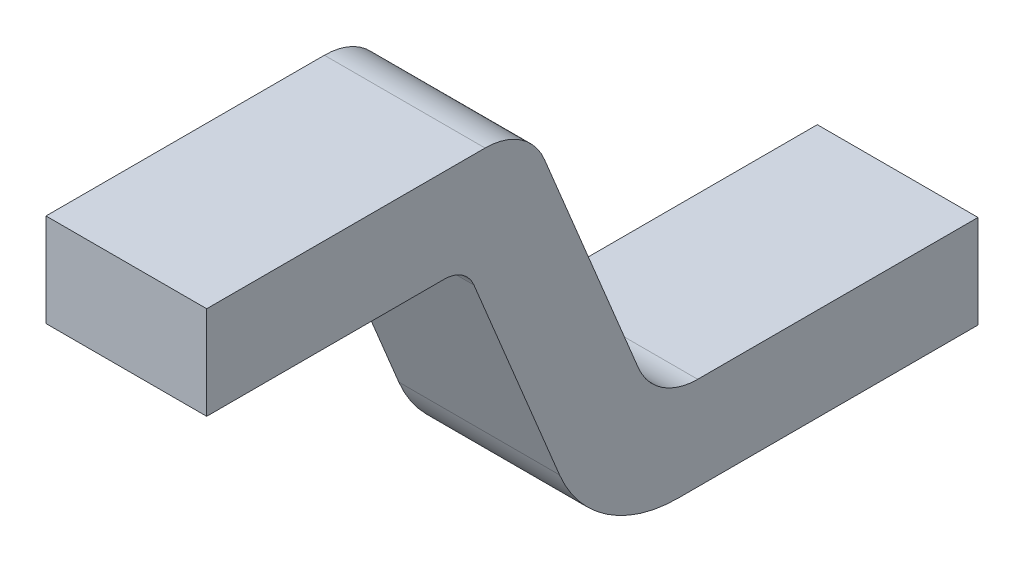
ISO-10303-21;
HEADER;
FILE_DESCRIPTION(('STEP AP214'),'2;1');
FILE_NAME('part.step','',(''),(''),'','','');
FILE_SCHEMA(('AUTOMOTIVE_DESIGN { 1 0 10303 214 1 1 1 1 }'));
ENDSEC;
DATA;
#1=APPLICATION_CONTEXT('core data for automotive mechanical design processes');
#2=APPLICATION_PROTOCOL_DEFINITION('international standard','automotive_design',2000,#1);
#3=PRODUCT_CONTEXT('',#1,'mechanical');
#4=PRODUCT('Part','Part','',(#3));
#5=PRODUCT_RELATED_PRODUCT_CATEGORY('part','',(#4));
#6=PRODUCT_DEFINITION_FORMATION('','',#4);
#7=PRODUCT_DEFINITION_CONTEXT('part definition',#1,'design');
#8=PRODUCT_DEFINITION('design','',#6,#7);
#9=PRODUCT_DEFINITION_SHAPE('','',#8);
#10=(LENGTH_UNIT() NAMED_UNIT(*) SI_UNIT(.MILLI.,.METRE.));
#11=(NAMED_UNIT(*) PLANE_ANGLE_UNIT() SI_UNIT($,.RADIAN.));
#12=(NAMED_UNIT(*) SI_UNIT($,.STERADIAN.) SOLID_ANGLE_UNIT());
#13=UNCERTAINTY_MEASURE_WITH_UNIT(LENGTH_MEASURE(1.E-05),#10,'distance_accuracy_value','');
#14=(GEOMETRIC_REPRESENTATION_CONTEXT(3) GLOBAL_UNCERTAINTY_ASSIGNED_CONTEXT((#13)) GLOBAL_UNIT_ASSIGNED_CONTEXT((#10,
#11,#12)) REPRESENTATION_CONTEXT('',''));
#15=CARTESIAN_POINT('',(0.,0.,0.));
#16=DIRECTION('',(0.,0.,1.));
#17=DIRECTION('',(1.,0.,0.));
#18=AXIS2_PLACEMENT_3D('',#15,#16,#17);
#19=CARTESIAN_POINT('',(0.25,-0.145,-0.169557608881));
#20=DIRECTION('',(0.,1.,0.));
#21=DIRECTION('',(0.,0.,-1.));
#22=AXIS2_PLACEMENT_3D('',#19,#20,#21);
#23=PLANE('',#22);
#24=DIRECTION('',(0.,0.,-1.));
#25=VECTOR('',#24,1.);
#26=CARTESIAN_POINT('',(0.,-0.145,-0.169557608881));
#27=LINE('',#26,#25);
#28=CARTESIAN_POINT('',(0.,-0.145,0.2));
#29=VERTEX_POINT('',#28);
#30=CARTESIAN_POINT('',(0.,-0.145,-0.169557608881));
#31=VERTEX_POINT('',#30);
#32=EDGE_CURVE('E10',#29,#31,#27,.T.);
#33=ORIENTED_EDGE('',*,*,#32,.T.);
#34=DIRECTION('',(-1.,0.,0.));
#35=VECTOR('',#34,1.);
#36=CARTESIAN_POINT('',(0.25,-0.145,-0.169557608881));
#37=LINE('',#36,#35);
#38=CARTESIAN_POINT('',(0.25,-0.145,-0.169557608881));
#39=VERTEX_POINT('',#38);
#40=EDGE_CURVE('E41',#39,#31,#37,.T.);
#41=ORIENTED_EDGE('',*,*,#40,.F.);
#42=DIRECTION('',(0.,0.,-1.));
#43=VECTOR('',#42,1.);
#44=CARTESIAN_POINT('',(0.25,-0.145,-0.169557608881));
#45=LINE('',#44,#43);
#46=CARTESIAN_POINT('',(0.25,-0.145,0.2));
#47=VERTEX_POINT('',#46);
#48=EDGE_CURVE('E124',#47,#39,#45,.T.);
#49=ORIENTED_EDGE('',*,*,#48,.F.);
#50=DIRECTION('',(1.,0.,0.));
#51=VECTOR('',#50,1.);
#52=CARTESIAN_POINT('',(0.,-0.145,0.2));
#53=LINE('',#52,#51);
#54=EDGE_CURVE('E121',#29,#47,#53,.T.);
#55=ORIENTED_EDGE('',*,*,#54,.F.);
#56=EDGE_LOOP('',(#33,#41,#49,#55));
#57=FACE_BOUND('',#56,.T.);
#58=ADVANCED_FACE('F16',(#57),#23,.F.);
#59=CARTESIAN_POINT('',(0.25,-0.195,-0.169557608881));
#60=DIRECTION('',(-1.,0.,0.));
#61=DIRECTION('',(0.,0.,1.));
#62=AXIS2_PLACEMENT_3D('',#59,#60,#61);
#63=CYLINDRICAL_SURFACE('',#62,0.05);
#64=CARTESIAN_POINT('',(0.,-0.195,-0.169557608881));
#65=DIRECTION('',(-1.,0.,0.));
#66=DIRECTION('',(0.,0.,-1.));
#67=AXIS2_PLACEMENT_3D('',#64,#65,#66);
#68=CIRCLE('',#67,0.05);
#69=CARTESIAN_POINT('',(0.,-0.175914153694,-0.215771572905));
#70=VERTEX_POINT('',#69);
#71=EDGE_CURVE('E27',#31,#70,#68,.T.);
#72=ORIENTED_EDGE('',*,*,#71,.T.);
#73=DIRECTION('',(-1.,0.,0.));
#74=VECTOR('',#73,1.);
#75=CARTESIAN_POINT('',(0.25,-0.175914153694,-0.215771572905));
#76=LINE('',#75,#74);
#77=CARTESIAN_POINT('',(0.25,-0.175914153694,-0.215771572905));
#78=VERTEX_POINT('',#77);
#79=EDGE_CURVE('E211',#78,#70,#76,.T.);
#80=ORIENTED_EDGE('',*,*,#79,.F.);
#81=CARTESIAN_POINT('',(0.25,-0.195,-0.169557608881));
#82=DIRECTION('',(-1.,0.,0.));
#83=DIRECTION('',(0.,0.,-1.));
#84=AXIS2_PLACEMENT_3D('',#81,#82,#83);
#85=CIRCLE('',#84,0.05);
#86=EDGE_CURVE('E177',#39,#78,#85,.T.);
#87=ORIENTED_EDGE('',*,*,#86,.F.);
#88=ORIENTED_EDGE('',*,*,#40,.T.);
#89=EDGE_LOOP('',(#72,#80,#87,#88));
#90=FACE_BOUND('',#89,.T.);
#91=ADVANCED_FACE('F302',(#90),#63,.F.);
#92=CARTESIAN_POINT('',(0.25,-0.498343385224,-0.348931211719));
#93=DIRECTION('',(0.,0.381716926120848,-0.92427928047363));
#94=DIRECTION('',(-1.,0.,0.));
#95=AXIS2_PLACEMENT_3D('',#92,#93,#94);
#96=PLANE('',#95);
#97=DIRECTION('',(0.,-0.92427928047363,-0.381716926120848));
#98=VECTOR('',#97,1.);
#99=CARTESIAN_POINT('',(0.,-0.498343385224,-0.348931211719));
#100=LINE('',#99,#98);
#101=CARTESIAN_POINT('',(0.,-0.498343385224,-0.348931211719));
#102=VERTEX_POINT('',#101);
#103=EDGE_CURVE('E214',#70,#102,#100,.T.);
#104=ORIENTED_EDGE('',*,*,#103,.T.);
#105=DIRECTION('',(-1.,0.,0.));
#106=VECTOR('',#105,1.);
#107=CARTESIAN_POINT('',(0.25,-0.498343385224,-0.348931211719));
#108=LINE('',#107,#106);
#109=CARTESIAN_POINT('',(0.25,-0.498343385224,-0.348931211719));
#110=VERTEX_POINT('',#109);
#111=EDGE_CURVE('E209',#110,#102,#108,.T.);
#112=ORIENTED_EDGE('',*,*,#111,.F.);
#113=DIRECTION('',(0.,-0.92427928047363,-0.381716926120848));
#114=VECTOR('',#113,1.);
#115=CARTESIAN_POINT('',(0.25,-0.498343385224,-0.348931211719));
#116=LINE('',#115,#114);
#117=EDGE_CURVE('E174',#78,#110,#116,.T.);
#118=ORIENTED_EDGE('',*,*,#117,.F.);
#119=ORIENTED_EDGE('',*,*,#79,.T.);
#120=EDGE_LOOP('',(#104,#112,#118,#119));
#121=FACE_BOUND('',#120,.T.);
#122=ADVANCED_FACE('F307',(#121),#96,.F.);
#123=CARTESIAN_POINT('',(0.25,-0.422,-0.533787067814));
#124=DIRECTION('',(-1.,0.,0.));
#125=DIRECTION('',(0.,0.,1.));
#126=AXIS2_PLACEMENT_3D('',#123,#124,#125);
#127=CYLINDRICAL_SURFACE('',#126,0.2);
#128=CARTESIAN_POINT('',(0.,-0.422,-0.533787067814));
#129=DIRECTION('',(1.,0.,0.));
#130=DIRECTION('',(0.,0.,1.));
#131=AXIS2_PLACEMENT_3D('',#128,#129,#130);
#132=CIRCLE('',#131,0.2);
#133=CARTESIAN_POINT('',(0.,-0.622,-0.533787067814));
#134=VERTEX_POINT('',#133);
#135=EDGE_CURVE('E20',#102,#134,#132,.T.);
#136=ORIENTED_EDGE('',*,*,#135,.T.);
#137=DIRECTION('',(-1.,0.,0.));
#138=VECTOR('',#137,1.);
#139=CARTESIAN_POINT('',(0.25,-0.622,-0.533787067814));
#140=LINE('',#139,#138);
#141=CARTESIAN_POINT('',(0.25,-0.622,-0.533787067814));
#142=VERTEX_POINT('',#141);
#143=EDGE_CURVE('E199',#142,#134,#140,.T.);
#144=ORIENTED_EDGE('',*,*,#143,.F.);
#145=CARTESIAN_POINT('',(0.25,-0.422,-0.533787067814));
#146=DIRECTION('',(1.,0.,0.));
#147=DIRECTION('',(0.,0.,1.));
#148=AXIS2_PLACEMENT_3D('',#145,#146,#147);
#149=CIRCLE('',#148,0.2);
#150=EDGE_CURVE('E170',#110,#142,#149,.T.);
#151=ORIENTED_EDGE('',*,*,#150,.F.);
#152=ORIENTED_EDGE('',*,*,#111,.T.);
#153=EDGE_LOOP('',(#136,#144,#151,#152));
#154=FACE_BOUND('',#153,.T.);
#155=ADVANCED_FACE('F355',(#154),#127,.T.);
#156=CARTESIAN_POINT('',(0.25,-0.622,-1.));
#157=DIRECTION('',(0.,1.,0.));
#158=DIRECTION('',(0.,0.,-1.));
#159=AXIS2_PLACEMENT_3D('',#156,#157,#158);
#160=PLANE('',#159);
#161=DIRECTION('',(0.,0.,-1.));
#162=VECTOR('',#161,1.);
#163=CARTESIAN_POINT('',(0.,-0.622,-1.));
#164=LINE('',#163,#162);
#165=CARTESIAN_POINT('',(0.,-0.622,-1.));
#166=VERTEX_POINT('',#165);
#167=EDGE_CURVE('E206',#134,#166,#164,.T.);
#168=ORIENTED_EDGE('',*,*,#167,.T.);
#169=DIRECTION('',(-1.,0.,0.));
#170=VECTOR('',#169,1.);
#171=CARTESIAN_POINT('',(0.25,-0.622,-1.));
#172=LINE('',#171,#170);
#173=CARTESIAN_POINT('',(0.25,-0.622,-1.));
#174=VERTEX_POINT('',#173);
#175=EDGE_CURVE('E200',#174,#166,#172,.T.);
#176=ORIENTED_EDGE('',*,*,#175,.F.);
#177=DIRECTION('',(0.,0.,-1.));
#178=VECTOR('',#177,1.);
#179=CARTESIAN_POINT('',(0.25,-0.622,-1.));
#180=LINE('',#179,#178);
#181=EDGE_CURVE('E153',#142,#174,#180,.T.);
#182=ORIENTED_EDGE('',*,*,#181,.F.);
#183=ORIENTED_EDGE('',*,*,#143,.T.);
#184=EDGE_LOOP('',(#168,#176,#182,#183));
#185=FACE_BOUND('',#184,.T.);
#186=ADVANCED_FACE('F287',(#185),#160,.F.);
#187=CARTESIAN_POINT('',(0.25,-0.477,-1.));
#188=DIRECTION('',(0.,0.,1.));
#189=DIRECTION('',(1.,0.,0.));
#190=AXIS2_PLACEMENT_3D('',#187,#188,#189);
#191=PLANE('',#190);
#192=DIRECTION('',(0.,1.,0.));
#193=VECTOR('',#192,1.);
#194=CARTESIAN_POINT('',(0.,-0.477,-1.));
#195=LINE('',#194,#193);
#196=CARTESIAN_POINT('',(0.,-0.477,-1.));
#197=VERTEX_POINT('',#196);
#198=EDGE_CURVE('E195',#166,#197,#195,.T.);
#199=ORIENTED_EDGE('',*,*,#198,.T.);
#200=DIRECTION('',(-1.,0.,0.));
#201=VECTOR('',#200,1.);
#202=CARTESIAN_POINT('',(0.25,-0.477,-1.));
#203=LINE('',#202,#201);
#204=CARTESIAN_POINT('',(0.25,-0.477,-1.));
#205=VERTEX_POINT('',#204);
#206=EDGE_CURVE('E186',#205,#197,#203,.T.);
#207=ORIENTED_EDGE('',*,*,#206,.F.);
#208=DIRECTION('',(0.,1.,0.));
#209=VECTOR('',#208,1.);
#210=CARTESIAN_POINT('',(0.25,-0.477,-1.));
#211=LINE('',#210,#209);
#212=EDGE_CURVE('E150',#174,#205,#211,.T.);
#213=ORIENTED_EDGE('',*,*,#212,.F.);
#214=ORIENTED_EDGE('',*,*,#175,.T.);
#215=EDGE_LOOP('',(#199,#207,#213,#214));
#216=FACE_BOUND('',#215,.T.);
#217=ADVANCED_FACE('F18',(#216),#191,.F.);
#218=CARTESIAN_POINT('',(0.25,-0.477,-0.563889158072));
#219=DIRECTION('',(0.,-1.,0.));
#220=DIRECTION('',(0.,0.,-1.));
#221=AXIS2_PLACEMENT_3D('',#218,#219,#220);
#222=PLANE('',#221);
#223=DIRECTION('',(0.,0.,1.));
#224=VECTOR('',#223,1.);
#225=CARTESIAN_POINT('',(0.,-0.477,-0.563889158072));
#226=LINE('',#225,#224);
#227=CARTESIAN_POINT('',(0.,-0.477,-0.563889158072));
#228=VERTEX_POINT('',#227);
#229=EDGE_CURVE('E189',#197,#228,#226,.T.);
#230=ORIENTED_EDGE('',*,*,#229,.T.);
#231=DIRECTION('',(-1.,0.,0.));
#232=VECTOR('',#231,1.);
#233=CARTESIAN_POINT('',(0.25,-0.477,-0.563889158072));
#234=LINE('',#233,#232);
#235=CARTESIAN_POINT('',(0.25,-0.477,-0.563889158072));
#236=VERTEX_POINT('',#235);
#237=EDGE_CURVE('E155',#236,#228,#234,.T.);
#238=ORIENTED_EDGE('',*,*,#237,.F.);
#239=DIRECTION('',(0.,0.,1.));
#240=VECTOR('',#239,1.);
#241=CARTESIAN_POINT('',(0.25,-0.477,-0.563889158072));
#242=LINE('',#241,#240);
#243=EDGE_CURVE('E154',#205,#236,#242,.T.);
#244=ORIENTED_EDGE('',*,*,#243,.F.);
#245=ORIENTED_EDGE('',*,*,#206,.T.);
#246=EDGE_LOOP('',(#230,#238,#244,#245));
#247=FACE_BOUND('',#246,.T.);
#248=ADVANCED_FACE('F294',(#247),#222,.F.);
#249=CARTESIAN_POINT('',(0.25,-0.377,-0.563889158072));
#250=DIRECTION('',(-1.,0.,0.));
#251=DIRECTION('',(0.,0.,1.));
#252=AXIS2_PLACEMENT_3D('',#249,#250,#251);
#253=CYLINDRICAL_SURFACE('',#252,0.1);
#254=CARTESIAN_POINT('',(0.,-0.377,-0.563889158072));
#255=DIRECTION('',(-1.,0.,0.));
#256=DIRECTION('',(0.,0.,-1.));
#257=AXIS2_PLACEMENT_3D('',#254,#255,#256);
#258=CIRCLE('',#257,0.1);
#259=CARTESIAN_POINT('',(0.,-0.415171692612,-0.471461230025));
#260=VERTEX_POINT('',#259);
#261=EDGE_CURVE('E158',#228,#260,#258,.T.);
#262=ORIENTED_EDGE('',*,*,#261,.T.);
#263=DIRECTION('',(-1.,0.,0.));
#264=VECTOR('',#263,1.);
#265=CARTESIAN_POINT('',(0.25,-0.415171692612,-0.471461230025));
#266=LINE('',#265,#264);
#267=CARTESIAN_POINT('',(0.25,-0.415171692612,-0.471461230025));
#268=VERTEX_POINT('',#267);
#269=EDGE_CURVE('E182',#268,#260,#266,.T.);
#270=ORIENTED_EDGE('',*,*,#269,.F.);
#271=CARTESIAN_POINT('',(0.25,-0.377,-0.563889158072));
#272=DIRECTION('',(-1.,0.,0.));
#273=DIRECTION('',(0.,0.,-1.));
#274=AXIS2_PLACEMENT_3D('',#271,#272,#273);
#275=CIRCLE('',#274,0.1);
#276=EDGE_CURVE('E172',#236,#268,#275,.T.);
#277=ORIENTED_EDGE('',*,*,#276,.F.);
#278=ORIENTED_EDGE('',*,*,#237,.T.);
#279=EDGE_LOOP('',(#262,#270,#277,#278));
#280=FACE_BOUND('',#279,.T.);
#281=ADVANCED_FACE('F296',(#280),#253,.F.);
#282=CARTESIAN_POINT('',(0.25,-0.06182830738789,-0.32553439414));
#283=DIRECTION('',(0.,-0.381716926120848,0.92427928047363));
#284=DIRECTION('',(-1.,0.,0.));
#285=AXIS2_PLACEMENT_3D('',#282,#283,#284);
#286=PLANE('',#285);
#287=DIRECTION('',(0.,0.92427928047363,0.381716926120848));
#288=VECTOR('',#287,1.);
#289=CARTESIAN_POINT('',(0.,-0.06182830738789,-0.32553439414));
#290=LINE('',#289,#288);
#291=CARTESIAN_POINT('',(0.,-0.06182830738789,-0.32553439414));
#292=VERTEX_POINT('',#291);
#293=EDGE_CURVE('E159',#260,#292,#290,.T.);
#294=ORIENTED_EDGE('',*,*,#293,.T.);
#295=DIRECTION('',(-1.,0.,0.));
#296=VECTOR('',#295,1.);
#297=CARTESIAN_POINT('',(0.25,-0.06182830738789,-0.32553439414));
#298=LINE('',#297,#296);
#299=CARTESIAN_POINT('',(0.25,-0.06182830738789,-0.32553439414));
#300=VERTEX_POINT('',#299);
#301=EDGE_CURVE('E183',#300,#292,#298,.T.);
#302=ORIENTED_EDGE('',*,*,#301,.F.);
#303=DIRECTION('',(0.,0.92427928047363,0.381716926120848));
#304=VECTOR('',#303,1.);
#305=CARTESIAN_POINT('',(0.25,-0.06182830738789,-0.32553439414));
#306=LINE('',#305,#304);
#307=EDGE_CURVE('E147',#268,#300,#306,.T.);
#308=ORIENTED_EDGE('',*,*,#307,.F.);
#309=ORIENTED_EDGE('',*,*,#269,.T.);
#310=EDGE_LOOP('',(#294,#302,#308,#309));
#311=FACE_BOUND('',#310,.T.);
#312=ADVANCED_FACE('F253',(#311),#286,.F.);
#313=CARTESIAN_POINT('',(0.25,-0.1,-0.233106466093));
#314=DIRECTION('',(-1.,0.,0.));
#315=DIRECTION('',(0.,0.,1.));
#316=AXIS2_PLACEMENT_3D('',#313,#314,#315);
#317=CYLINDRICAL_SURFACE('',#316,0.1);
#318=CARTESIAN_POINT('',(0.,-0.1,-0.233106466093));
#319=DIRECTION('',(1.,0.,0.));
#320=DIRECTION('',(0.,0.,1.));
#321=AXIS2_PLACEMENT_3D('',#318,#319,#320);
#322=CIRCLE('',#321,0.1);
#323=CARTESIAN_POINT('',(0.,0.,-0.233106466093));
#324=VERTEX_POINT('',#323);
#325=EDGE_CURVE('E178',#292,#324,#322,.T.);
#326=ORIENTED_EDGE('',*,*,#325,.T.);
#327=DIRECTION('',(-1.,0.,0.));
#328=VECTOR('',#327,1.);
#329=CARTESIAN_POINT('',(0.25,0.,-0.233106466093));
#330=LINE('',#329,#328);
#331=CARTESIAN_POINT('',(0.25,0.,-0.233106466093));
#332=VERTEX_POINT('',#331);
#333=EDGE_CURVE('E160',#332,#324,#330,.T.);
#334=ORIENTED_EDGE('',*,*,#333,.F.);
#335=CARTESIAN_POINT('',(0.25,-0.1,-0.233106466093));
#336=DIRECTION('',(1.,0.,0.));
#337=DIRECTION('',(0.,0.,1.));
#338=AXIS2_PLACEMENT_3D('',#335,#336,#337);
#339=CIRCLE('',#338,0.1);
#340=EDGE_CURVE('E143',#300,#332,#339,.T.);
#341=ORIENTED_EDGE('',*,*,#340,.F.);
#342=ORIENTED_EDGE('',*,*,#301,.T.);
#343=EDGE_LOOP('',(#326,#334,#341,#342));
#344=FACE_BOUND('',#343,.T.);
#345=ADVANCED_FACE('F260',(#344),#317,.T.);
#346=CARTESIAN_POINT('',(0.25,0.,0.));
#347=DIRECTION('',(0.,-1.,0.));
#348=DIRECTION('',(0.,0.,-1.));
#349=AXIS2_PLACEMENT_3D('',#346,#347,#348);
#350=PLANE('',#349);
#351=DIRECTION('',(0.,0.,1.));
#352=VECTOR('',#351,1.);
#353=CARTESIAN_POINT('',(0.,0.,0.));
#354=LINE('',#353,#352);
#355=CARTESIAN_POINT('',(0.,0.,0.2));
#356=VERTEX_POINT('',#355);
#357=EDGE_CURVE('E163',#324,#356,#354,.T.);
#358=ORIENTED_EDGE('',*,*,#357,.T.);
#359=DIRECTION('',(-1.,0.,0.));
#360=VECTOR('',#359,1.);
#361=CARTESIAN_POINT('',(0.,0.,0.2));
#362=LINE('',#361,#360);
#363=CARTESIAN_POINT('',(0.25,0.,0.2));
#364=VERTEX_POINT('',#363);
#365=EDGE_CURVE('E140',#364,#356,#362,.T.);
#366=ORIENTED_EDGE('',*,*,#365,.F.);
#367=DIRECTION('',(0.,0.,1.));
#368=VECTOR('',#367,1.);
#369=CARTESIAN_POINT('',(0.25,0.,0.));
#370=LINE('',#369,#368);
#371=EDGE_CURVE('E164',#332,#364,#370,.T.);
#372=ORIENTED_EDGE('',*,*,#371,.F.);
#373=ORIENTED_EDGE('',*,*,#333,.T.);
#374=EDGE_LOOP('',(#358,#366,#372,#373));
#375=FACE_BOUND('',#374,.T.);
#376=ADVANCED_FACE('F329',(#375),#350,.F.);
#377=CARTESIAN_POINT('',(0.25,-0.1,-0.233106466093));
#378=DIRECTION('',(-1.,0.,0.));
#379=DIRECTION('',(0.,0.,1.));
#380=AXIS2_PLACEMENT_3D('',#377,#378,#379);
#381=PLANE('',#380);
#382=ORIENTED_EDGE('',*,*,#371,.T.);
#383=DIRECTION('',(0.,1.,0.));
#384=VECTOR('',#383,1.);
#385=CARTESIAN_POINT('',(0.25,0.,0.2));
#386=LINE('',#385,#384);
#387=EDGE_CURVE('E131',#47,#364,#386,.T.);
#388=ORIENTED_EDGE('',*,*,#387,.F.);
#389=ORIENTED_EDGE('',*,*,#48,.T.);
#390=ORIENTED_EDGE('',*,*,#86,.T.);
#391=ORIENTED_EDGE('',*,*,#117,.T.);
#392=ORIENTED_EDGE('',*,*,#150,.T.);
#393=ORIENTED_EDGE('',*,*,#181,.T.);
#394=ORIENTED_EDGE('',*,*,#212,.T.);
#395=ORIENTED_EDGE('',*,*,#243,.T.);
#396=ORIENTED_EDGE('',*,*,#276,.T.);
#397=ORIENTED_EDGE('',*,*,#307,.T.);
#398=ORIENTED_EDGE('',*,*,#340,.T.);
#399=EDGE_LOOP('',(#382,#388,#389,#390,#391,#392,#393,#394,#395,#396,#397,#398));
#400=FACE_BOUND('',#399,.T.);
#401=ADVANCED_FACE('F263',(#400),#381,.F.);
#402=CARTESIAN_POINT('',(0.,-0.1,-0.233106466093));
#403=DIRECTION('',(-1.,0.,0.));
#404=DIRECTION('',(0.,0.,1.));
#405=AXIS2_PLACEMENT_3D('',#402,#403,#404);
#406=PLANE('',#405);
#407=ORIENTED_EDGE('',*,*,#32,.F.);
#408=DIRECTION('',(0.,-1.,0.));
#409=VECTOR('',#408,1.);
#410=CARTESIAN_POINT('',(0.,0.,0.2));
#411=LINE('',#410,#409);
#412=EDGE_CURVE('E130',#356,#29,#411,.T.);
#413=ORIENTED_EDGE('',*,*,#412,.F.);
#414=ORIENTED_EDGE('',*,*,#357,.F.);
#415=ORIENTED_EDGE('',*,*,#325,.F.);
#416=ORIENTED_EDGE('',*,*,#293,.F.);
#417=ORIENTED_EDGE('',*,*,#261,.F.);
#418=ORIENTED_EDGE('',*,*,#229,.F.);
#419=ORIENTED_EDGE('',*,*,#198,.F.);
#420=ORIENTED_EDGE('',*,*,#167,.F.);
#421=ORIENTED_EDGE('',*,*,#135,.F.);
#422=ORIENTED_EDGE('',*,*,#103,.F.);
#423=ORIENTED_EDGE('',*,*,#71,.F.);
#424=EDGE_LOOP('',(#407,#413,#414,#415,#416,#417,#418,#419,#420,#421,#422,#423));
#425=FACE_BOUND('',#424,.T.);
#426=ADVANCED_FACE('F135',(#425),#406,.T.);
#427=CARTESIAN_POINT('',(0.,-0.145,0.2));
#428=DIRECTION('',(0.,0.,1.));
#429=DIRECTION('',(1.,0.,0.));
#430=AXIS2_PLACEMENT_3D('',#427,#428,#429);
#431=PLANE('',#430);
#432=ORIENTED_EDGE('',*,*,#412,.T.);
#433=ORIENTED_EDGE('',*,*,#54,.T.);
#434=ORIENTED_EDGE('',*,*,#387,.T.);
#435=ORIENTED_EDGE('',*,*,#365,.T.);
#436=EDGE_LOOP('',(#432,#433,#434,#435));
#437=FACE_BOUND('',#436,.T.);
#438=ADVANCED_FACE('F139',(#437),#431,.T.);
#439=CLOSED_SHELL('',(#58,#91,#122,#155,#186,#217,#248,#281,#312,#345,#376,#401,#426,#438));
#440=MANIFOLD_SOLID_BREP('B1',#439);
#441=ADVANCED_BREP_SHAPE_REPRESENTATION('',(#18,#440),#14);
#442=SHAPE_DEFINITION_REPRESENTATION(#9,#441);
ENDSEC;
END-ISO-10303-21;
